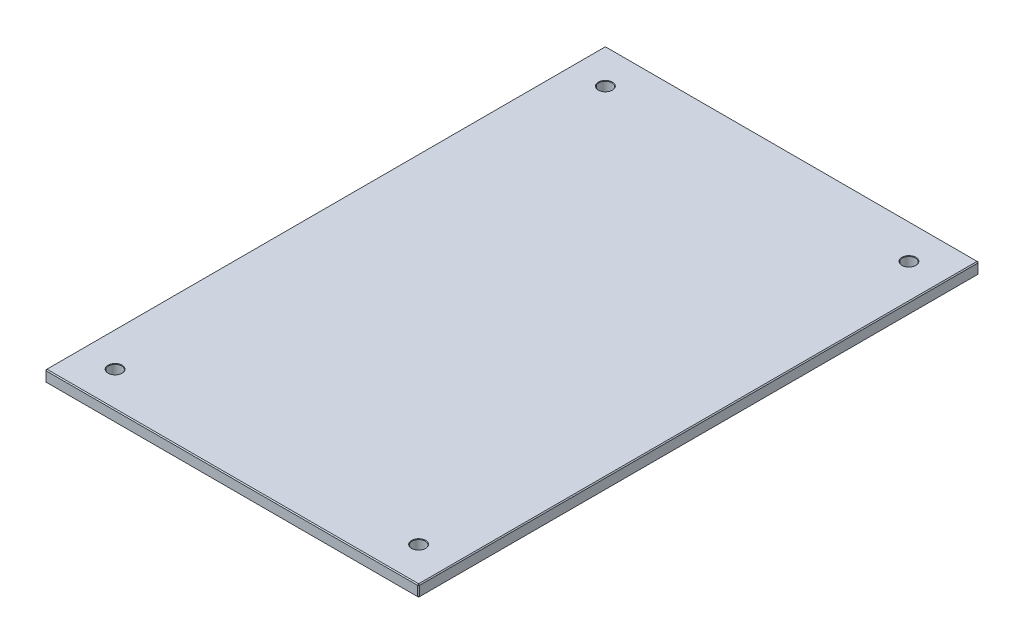
ISO-10303-21;
HEADER;
FILE_DESCRIPTION(('STEP AP214'),'2;1');
FILE_NAME('part.step','',(''),(''),'','','');
FILE_SCHEMA(('AUTOMOTIVE_DESIGN { 1 0 10303 214 1 1 1 1 }'));
ENDSEC;
DATA;
#1=APPLICATION_CONTEXT('core data for automotive mechanical design processes');
#2=APPLICATION_PROTOCOL_DEFINITION('international standard','automotive_design',2000,#1);
#3=PRODUCT_CONTEXT('',#1,'mechanical');
#4=PRODUCT('Part','Part','',(#3));
#5=PRODUCT_RELATED_PRODUCT_CATEGORY('part','',(#4));
#6=PRODUCT_DEFINITION_FORMATION('','',#4);
#7=PRODUCT_DEFINITION_CONTEXT('part definition',#1,'design');
#8=PRODUCT_DEFINITION('design','',#6,#7);
#9=PRODUCT_DEFINITION_SHAPE('','',#8);
#10=(LENGTH_UNIT() NAMED_UNIT(*) SI_UNIT(.MILLI.,.METRE.));
#11=(NAMED_UNIT(*) PLANE_ANGLE_UNIT() SI_UNIT($,.RADIAN.));
#12=(NAMED_UNIT(*) SI_UNIT($,.STERADIAN.) SOLID_ANGLE_UNIT());
#13=UNCERTAINTY_MEASURE_WITH_UNIT(LENGTH_MEASURE(1.E-05),#10,'distance_accuracy_value','');
#14=(GEOMETRIC_REPRESENTATION_CONTEXT(3) GLOBAL_UNCERTAINTY_ASSIGNED_CONTEXT((#13)) GLOBAL_UNIT_ASSIGNED_CONTEXT((#10,
#11,#12)) REPRESENTATION_CONTEXT('',''));
#15=CARTESIAN_POINT('',(0.,0.,0.));
#16=DIRECTION('',(0.,0.,1.));
#17=DIRECTION('',(1.,0.,0.));
#18=AXIS2_PLACEMENT_3D('',#15,#16,#17);
#19=CARTESIAN_POINT('',(101.6,3.175,152.4));
#20=DIRECTION('',(-1.,0.,0.));
#21=DIRECTION('',(0.,0.,1.));
#22=AXIS2_PLACEMENT_3D('',#19,#20,#21);
#23=PLANE('',#22);
#24=DIRECTION('',(0.,0.,-1.));
#25=VECTOR('',#24,1.);
#26=CARTESIAN_POINT('',(101.6,-2.66699999999999,-152.4));
#27=LINE('',#26,#25);
#28=CARTESIAN_POINT('',(101.6,-2.66699999999999,151.892));
#29=VERTEX_POINT('',#28);
#30=CARTESIAN_POINT('',(101.6,-2.66699999999999,-151.892));
#31=VERTEX_POINT('',#30);
#32=EDGE_CURVE('E178',#29,#31,#27,.T.);
#33=ORIENTED_EDGE('',*,*,#32,.T.);
#34=DIRECTION('',(0.,1.,0.));
#35=VECTOR('',#34,1.);
#36=CARTESIAN_POINT('',(101.6,3.175,-151.892));
#37=LINE('',#36,#35);
#38=CARTESIAN_POINT('',(101.6,2.66699999999999,-151.892));
#39=VERTEX_POINT('',#38);
#40=EDGE_CURVE('E183',#31,#39,#37,.T.);
#41=ORIENTED_EDGE('',*,*,#40,.T.);
#42=DIRECTION('',(0.,0.,1.));
#43=VECTOR('',#42,1.);
#44=CARTESIAN_POINT('',(101.6,2.66699999999999,152.4));
#45=LINE('',#44,#43);
#46=CARTESIAN_POINT('',(101.6,2.66699999999999,151.892));
#47=VERTEX_POINT('',#46);
#48=EDGE_CURVE('E180',#39,#47,#45,.T.);
#49=ORIENTED_EDGE('',*,*,#48,.T.);
#50=DIRECTION('',(0.,-1.,0.));
#51=VECTOR('',#50,1.);
#52=CARTESIAN_POINT('',(101.6,3.175,151.892));
#53=LINE('',#52,#51);
#54=EDGE_CURVE('E176',#47,#29,#53,.T.);
#55=ORIENTED_EDGE('',*,*,#54,.T.);
#56=EDGE_LOOP('',(#33,#41,#49,#55));
#57=FACE_BOUND('',#56,.T.);
#58=ADVANCED_FACE('F41',(#57),#23,.F.);
#59=CARTESIAN_POINT('',(-101.6,3.175,-152.4));
#60=DIRECTION('',(0.,0.,1.));
#61=DIRECTION('',(1.,0.,0.));
#62=AXIS2_PLACEMENT_3D('',#59,#60,#61);
#63=PLANE('',#62);
#64=DIRECTION('',(1.,0.,0.));
#65=VECTOR('',#64,1.);
#66=CARTESIAN_POINT('',(-101.6,2.66699999999999,-152.4));
#67=LINE('',#66,#65);
#68=CARTESIAN_POINT('',(-101.092,2.66699999999999,-152.4));
#69=VERTEX_POINT('',#68);
#70=CARTESIAN_POINT('',(101.092,2.66699999999999,-152.4));
#71=VERTEX_POINT('',#70);
#72=EDGE_CURVE('E198',#69,#71,#67,.T.);
#73=ORIENTED_EDGE('',*,*,#72,.T.);
#74=DIRECTION('',(0.,-1.,0.));
#75=VECTOR('',#74,1.);
#76=CARTESIAN_POINT('',(101.092,3.175,-152.4));
#77=LINE('',#76,#75);
#78=CARTESIAN_POINT('',(101.092,-2.66699999999999,-152.4));
#79=VERTEX_POINT('',#78);
#80=EDGE_CURVE('E200',#71,#79,#77,.T.);
#81=ORIENTED_EDGE('',*,*,#80,.T.);
#82=DIRECTION('',(-1.,0.,0.));
#83=VECTOR('',#82,1.);
#84=CARTESIAN_POINT('',(-101.6,-2.66699999999999,-152.4));
#85=LINE('',#84,#83);
#86=CARTESIAN_POINT('',(-101.092,-2.66699999999999,-152.4));
#87=VERTEX_POINT('',#86);
#88=EDGE_CURVE('E196',#79,#87,#85,.T.);
#89=ORIENTED_EDGE('',*,*,#88,.T.);
#90=DIRECTION('',(0.,1.,0.));
#91=VECTOR('',#90,1.);
#92=CARTESIAN_POINT('',(-101.092,3.175,-152.4));
#93=LINE('',#92,#91);
#94=EDGE_CURVE('E194',#87,#69,#93,.T.);
#95=ORIENTED_EDGE('',*,*,#94,.T.);
#96=EDGE_LOOP('',(#73,#81,#89,#95));
#97=FACE_BOUND('',#96,.T.);
#98=ADVANCED_FACE('F344',(#97),#63,.F.);
#99=CARTESIAN_POINT('',(-101.6,3.175,152.4));
#100=DIRECTION('',(1.,0.,0.));
#101=DIRECTION('',(0.,0.,-1.));
#102=AXIS2_PLACEMENT_3D('',#99,#100,#101);
#103=PLANE('',#102);
#104=DIRECTION('',(0.,0.,-1.));
#105=VECTOR('',#104,1.);
#106=CARTESIAN_POINT('',(-101.6,2.66699999999999,152.4));
#107=LINE('',#106,#105);
#108=CARTESIAN_POINT('',(-101.6,2.66699999999999,151.892));
#109=VERTEX_POINT('',#108);
#110=CARTESIAN_POINT('',(-101.6,2.66699999999999,-151.892));
#111=VERTEX_POINT('',#110);
#112=EDGE_CURVE('E148',#109,#111,#107,.T.);
#113=ORIENTED_EDGE('',*,*,#112,.T.);
#114=DIRECTION('',(0.,-1.,0.));
#115=VECTOR('',#114,1.);
#116=CARTESIAN_POINT('',(-101.6,3.175,-151.892));
#117=LINE('',#116,#115);
#118=CARTESIAN_POINT('',(-101.6,-2.66699999999999,-151.892));
#119=VERTEX_POINT('',#118);
#120=EDGE_CURVE('E208',#111,#119,#117,.T.);
#121=ORIENTED_EDGE('',*,*,#120,.T.);
#122=DIRECTION('',(0.,0.,1.));
#123=VECTOR('',#122,1.);
#124=CARTESIAN_POINT('',(-101.6,-2.66699999999999,152.4));
#125=LINE('',#124,#123);
#126=CARTESIAN_POINT('',(-101.6,-2.66699999999999,151.892));
#127=VERTEX_POINT('',#126);
#128=EDGE_CURVE('E205',#119,#127,#125,.T.);
#129=ORIENTED_EDGE('',*,*,#128,.T.);
#130=DIRECTION('',(0.,1.,0.));
#131=VECTOR('',#130,1.);
#132=CARTESIAN_POINT('',(-101.6,3.175,151.892));
#133=LINE('',#132,#131);
#134=EDGE_CURVE('E203',#127,#109,#133,.T.);
#135=ORIENTED_EDGE('',*,*,#134,.T.);
#136=EDGE_LOOP('',(#113,#121,#129,#135));
#137=FACE_BOUND('',#136,.T.);
#138=ADVANCED_FACE('F340',(#137),#103,.F.);
#139=CARTESIAN_POINT('',(-101.6,3.175,152.4));
#140=DIRECTION('',(0.,0.,-1.));
#141=DIRECTION('',(-1.,0.,0.));
#142=AXIS2_PLACEMENT_3D('',#139,#140,#141);
#143=PLANE('',#142);
#144=DIRECTION('',(-1.,0.,0.));
#145=VECTOR('',#144,1.);
#146=CARTESIAN_POINT('',(-101.6,2.66699999999999,152.4));
#147=LINE('',#146,#145);
#148=CARTESIAN_POINT('',(101.092,2.66699999999999,152.4));
#149=VERTEX_POINT('',#148);
#150=CARTESIAN_POINT('',(-101.092,2.66699999999999,152.4));
#151=VERTEX_POINT('',#150);
#152=EDGE_CURVE('E51',#149,#151,#147,.T.);
#153=ORIENTED_EDGE('',*,*,#152,.T.);
#154=DIRECTION('',(0.,-1.,0.));
#155=VECTOR('',#154,1.);
#156=CARTESIAN_POINT('',(-101.092,3.175,152.4));
#157=LINE('',#156,#155);
#158=CARTESIAN_POINT('',(-101.092,-2.66699999999999,152.4));
#159=VERTEX_POINT('',#158);
#160=EDGE_CURVE('E11',#151,#159,#157,.T.);
#161=ORIENTED_EDGE('',*,*,#160,.T.);
#162=DIRECTION('',(1.,0.,0.));
#163=VECTOR('',#162,1.);
#164=CARTESIAN_POINT('',(101.6,-2.66699999999999,152.4));
#165=LINE('',#164,#163);
#166=CARTESIAN_POINT('',(101.092,-2.66699999999999,152.4));
#167=VERTEX_POINT('',#166);
#168=EDGE_CURVE('E211',#159,#167,#165,.T.);
#169=ORIENTED_EDGE('',*,*,#168,.T.);
#170=DIRECTION('',(0.,1.,0.));
#171=VECTOR('',#170,1.);
#172=CARTESIAN_POINT('',(101.092,3.175,152.4));
#173=LINE('',#172,#171);
#174=EDGE_CURVE('E62',#167,#149,#173,.T.);
#175=ORIENTED_EDGE('',*,*,#174,.T.);
#176=EDGE_LOOP('',(#153,#161,#169,#175));
#177=FACE_BOUND('',#176,.T.);
#178=ADVANCED_FACE('F331',(#177),#143,.F.);
#179=CARTESIAN_POINT('',(0.,3.175,0.));
#180=DIRECTION('',(0.,-1.,0.));
#181=DIRECTION('',(0.,0.,-1.));
#182=AXIS2_PLACEMENT_3D('',#179,#180,#181);
#183=PLANE('',#182);
#184=DIRECTION('',(1.,0.,0.));
#185=VECTOR('',#184,1.);
#186=CARTESIAN_POINT('',(0.,3.175,151.892));
#187=LINE('',#186,#185);
#188=CARTESIAN_POINT('',(-101.092,3.175,151.892));
#189=VERTEX_POINT('',#188);
#190=CARTESIAN_POINT('',(101.092,3.175,151.892));
#191=VERTEX_POINT('',#190);
#192=EDGE_CURVE('E135',#189,#191,#187,.T.);
#193=ORIENTED_EDGE('',*,*,#192,.T.);
#194=DIRECTION('',(0.,0.,-1.));
#195=VECTOR('',#194,1.);
#196=CARTESIAN_POINT('',(101.092,3.175,0.));
#197=LINE('',#196,#195);
#198=CARTESIAN_POINT('',(101.092,3.175,-151.892));
#199=VERTEX_POINT('',#198);
#200=EDGE_CURVE('E174',#191,#199,#197,.T.);
#201=ORIENTED_EDGE('',*,*,#200,.T.);
#202=DIRECTION('',(-1.,0.,0.));
#203=VECTOR('',#202,1.);
#204=CARTESIAN_POINT('',(0.,3.175,-151.892));
#205=LINE('',#204,#203);
#206=CARTESIAN_POINT('',(-101.092,3.175,-151.892));
#207=VERTEX_POINT('',#206);
#208=EDGE_CURVE('E138',#199,#207,#205,.T.);
#209=ORIENTED_EDGE('',*,*,#208,.T.);
#210=DIRECTION('',(0.,0.,1.));
#211=VECTOR('',#210,1.);
#212=CARTESIAN_POINT('',(-101.092,3.175,0.));
#213=LINE('',#212,#211);
#214=EDGE_CURVE('E129',#207,#189,#213,.T.);
#215=ORIENTED_EDGE('',*,*,#214,.T.);
#216=EDGE_LOOP('',(#193,#201,#209,#215));
#217=FACE_BOUND('',#216,.T.);
#218=CARTESIAN_POINT('',(-82.55,3.175,-133.35));
#219=DIRECTION('',(0.,1.,0.));
#220=DIRECTION('',(0.,0.,1.));
#221=AXIS2_PLACEMENT_3D('',#218,#219,#220);
#222=CIRCLE('',#221,3.82523999999999);
#223=CARTESIAN_POINT('',(-82.55,3.175,-129.52476));
#224=VERTEX_POINT('',#223);
#225=EDGE_CURVE('E275',#224,#224,#222,.T.);
#226=ORIENTED_EDGE('',*,*,#225,.F.);
#227=EDGE_LOOP('',(#226));
#228=FACE_BOUND('',#227,.T.);
#229=CARTESIAN_POINT('',(82.55,3.175,-133.35));
#230=DIRECTION('',(0.,1.,0.));
#231=DIRECTION('',(0.,0.,1.));
#232=AXIS2_PLACEMENT_3D('',#229,#230,#231);
#233=CIRCLE('',#232,3.82523999999999);
#234=CARTESIAN_POINT('',(82.55,3.175,-129.52476));
#235=VERTEX_POINT('',#234);
#236=EDGE_CURVE('E291',#235,#235,#233,.T.);
#237=ORIENTED_EDGE('',*,*,#236,.F.);
#238=EDGE_LOOP('',(#237));
#239=FACE_BOUND('',#238,.T.);
#240=CARTESIAN_POINT('',(82.55,3.175,133.35));
#241=DIRECTION('',(0.,1.,0.));
#242=DIRECTION('',(0.,0.,1.));
#243=AXIS2_PLACEMENT_3D('',#240,#241,#242);
#244=CIRCLE('',#243,3.82523999999999);
#245=CARTESIAN_POINT('',(82.55,3.175,137.17524));
#246=VERTEX_POINT('',#245);
#247=EDGE_CURVE('E303',#246,#246,#244,.T.);
#248=ORIENTED_EDGE('',*,*,#247,.F.);
#249=EDGE_LOOP('',(#248));
#250=FACE_BOUND('',#249,.T.);
#251=CARTESIAN_POINT('',(-82.55,3.175,133.35));
#252=DIRECTION('',(0.,1.,0.));
#253=DIRECTION('',(0.,0.,1.));
#254=AXIS2_PLACEMENT_3D('',#251,#252,#253);
#255=CIRCLE('',#254,3.82523999999999);
#256=CARTESIAN_POINT('',(-82.55,3.175,137.17524));
#257=VERTEX_POINT('',#256);
#258=EDGE_CURVE('E315',#257,#257,#255,.T.);
#259=ORIENTED_EDGE('',*,*,#258,.F.);
#260=EDGE_LOOP('',(#259));
#261=FACE_BOUND('',#260,.T.);
#262=ADVANCED_FACE('F131',(#217,#228,#239,#250,#261),#183,.F.);
#263=CARTESIAN_POINT('',(0.,-3.175,0.));
#264=DIRECTION('',(0.,-1.,0.));
#265=DIRECTION('',(0.,0.,-1.));
#266=AXIS2_PLACEMENT_3D('',#263,#264,#265);
#267=PLANE('',#266);
#268=DIRECTION('',(1.,0.,0.));
#269=VECTOR('',#268,1.);
#270=CARTESIAN_POINT('',(101.6,-3.175,-151.892));
#271=LINE('',#270,#269);
#272=CARTESIAN_POINT('',(-101.092,-3.175,-151.892));
#273=VERTEX_POINT('',#272);
#274=CARTESIAN_POINT('',(101.092,-3.175,-151.892));
#275=VERTEX_POINT('',#274);
#276=EDGE_CURVE('E189',#273,#275,#271,.T.);
#277=ORIENTED_EDGE('',*,*,#276,.T.);
#278=DIRECTION('',(0.,0.,1.));
#279=VECTOR('',#278,1.);
#280=CARTESIAN_POINT('',(101.092,-3.175,152.4));
#281=LINE('',#280,#279);
#282=CARTESIAN_POINT('',(101.092,-3.175,151.892));
#283=VERTEX_POINT('',#282);
#284=EDGE_CURVE('E191',#275,#283,#281,.T.);
#285=ORIENTED_EDGE('',*,*,#284,.T.);
#286=DIRECTION('',(-1.,0.,0.));
#287=VECTOR('',#286,1.);
#288=CARTESIAN_POINT('',(-101.6,-3.175,151.892));
#289=LINE('',#288,#287);
#290=CARTESIAN_POINT('',(-101.092,-3.175,151.892));
#291=VERTEX_POINT('',#290);
#292=EDGE_CURVE('E185',#283,#291,#289,.T.);
#293=ORIENTED_EDGE('',*,*,#292,.T.);
#294=DIRECTION('',(0.,0.,-1.));
#295=VECTOR('',#294,1.);
#296=CARTESIAN_POINT('',(-101.092,-3.175,-152.4));
#297=LINE('',#296,#295);
#298=EDGE_CURVE('E187',#291,#273,#297,.T.);
#299=ORIENTED_EDGE('',*,*,#298,.T.);
#300=EDGE_LOOP('',(#277,#285,#293,#299));
#301=FACE_BOUND('',#300,.T.);
#302=CARTESIAN_POINT('',(-82.55,-3.175,-133.35));
#303=DIRECTION('',(0.,1.,0.));
#304=DIRECTION('',(0.,0.,1.));
#305=AXIS2_PLACEMENT_3D('',#302,#303,#304);
#306=CIRCLE('',#305,3.82523999999999);
#307=CARTESIAN_POINT('',(-82.55,-3.175,-129.52476));
#308=VERTEX_POINT('',#307);
#309=EDGE_CURVE('E269',#308,#308,#306,.T.);
#310=ORIENTED_EDGE('',*,*,#309,.T.);
#311=EDGE_LOOP('',(#310));
#312=FACE_BOUND('',#311,.T.);
#313=CARTESIAN_POINT('',(82.55,-3.175,-133.35));
#314=DIRECTION('',(0.,1.,0.));
#315=DIRECTION('',(0.,0.,1.));
#316=AXIS2_PLACEMENT_3D('',#313,#314,#315);
#317=CIRCLE('',#316,3.82523999999999);
#318=CARTESIAN_POINT('',(82.55,-3.175,-129.52476));
#319=VERTEX_POINT('',#318);
#320=EDGE_CURVE('E288',#319,#319,#317,.T.);
#321=ORIENTED_EDGE('',*,*,#320,.T.);
#322=EDGE_LOOP('',(#321));
#323=FACE_BOUND('',#322,.T.);
#324=CARTESIAN_POINT('',(82.55,-3.175,133.35));
#325=DIRECTION('',(0.,1.,0.));
#326=DIRECTION('',(0.,0.,1.));
#327=AXIS2_PLACEMENT_3D('',#324,#325,#326);
#328=CIRCLE('',#327,3.82523999999999);
#329=CARTESIAN_POINT('',(82.55,-3.175,137.17524));
#330=VERTEX_POINT('',#329);
#331=EDGE_CURVE('E300',#330,#330,#328,.T.);
#332=ORIENTED_EDGE('',*,*,#331,.T.);
#333=EDGE_LOOP('',(#332));
#334=FACE_BOUND('',#333,.T.);
#335=CARTESIAN_POINT('',(-82.55,-3.175,133.35));
#336=DIRECTION('',(0.,1.,0.));
#337=DIRECTION('',(0.,0.,1.));
#338=AXIS2_PLACEMENT_3D('',#335,#336,#337);
#339=CIRCLE('',#338,3.82523999999999);
#340=CARTESIAN_POINT('',(-82.55,-3.175,137.17524));
#341=VERTEX_POINT('',#340);
#342=EDGE_CURVE('E312',#341,#341,#339,.T.);
#343=ORIENTED_EDGE('',*,*,#342,.T.);
#344=EDGE_LOOP('',(#343));
#345=FACE_BOUND('',#344,.T.);
#346=ADVANCED_FACE('F330',(#301,#312,#323,#334,#345),#267,.T.);
#347=CARTESIAN_POINT('',(-82.55,-2.921,133.35));
#348=DIRECTION('',(0.,-1.,0.));
#349=DIRECTION('',(0.,0.,-1.));
#350=AXIS2_PLACEMENT_3D('',#347,#348,#349);
#351=CONICAL_SURFACE('',#350,3.57124,0.785398163397426);
#352=ORIENTED_EDGE('',*,*,#342,.F.);
#353=EDGE_LOOP('',(#352));
#354=FACE_BOUND('',#353,.T.);
#355=CARTESIAN_POINT('',(-82.55,-2.921,133.35));
#356=DIRECTION('',(0.,1.,0.));
#357=DIRECTION('',(0.,0.,1.));
#358=AXIS2_PLACEMENT_3D('',#355,#356,#357);
#359=CIRCLE('',#358,3.57124);
#360=CARTESIAN_POINT('',(-82.55,-2.921,136.92124));
#361=VERTEX_POINT('',#360);
#362=EDGE_CURVE('E166',#361,#361,#359,.T.);
#363=ORIENTED_EDGE('',*,*,#362,.T.);
#364=EDGE_LOOP('',(#363));
#365=FACE_BOUND('',#364,.T.);
#366=ADVANCED_FACE('F337',(#354,#365),#351,.F.);
#367=CARTESIAN_POINT('',(-82.55,3.175,133.35));
#368=DIRECTION('',(0.,1.,0.));
#369=DIRECTION('',(0.,0.,1.));
#370=AXIS2_PLACEMENT_3D('',#367,#368,#369);
#371=CYLINDRICAL_SURFACE('',#370,3.57124);
#372=ORIENTED_EDGE('',*,*,#362,.F.);
#373=EDGE_LOOP('',(#372));
#374=FACE_BOUND('',#373,.T.);
#375=CARTESIAN_POINT('',(-82.55,2.921,133.35));
#376=DIRECTION('',(0.,1.,0.));
#377=DIRECTION('',(0.,0.,1.));
#378=AXIS2_PLACEMENT_3D('',#375,#376,#377);
#379=CIRCLE('',#378,3.57124);
#380=CARTESIAN_POINT('',(-82.55,2.921,136.92124));
#381=VERTEX_POINT('',#380);
#382=EDGE_CURVE('E169',#381,#381,#379,.T.);
#383=ORIENTED_EDGE('',*,*,#382,.T.);
#384=EDGE_LOOP('',(#383));
#385=FACE_BOUND('',#384,.T.);
#386=ADVANCED_FACE('F320',(#374,#385),#371,.F.);
#387=CARTESIAN_POINT('',(-82.55,3.175,133.35));
#388=DIRECTION('',(0.,1.,0.));
#389=DIRECTION('',(0.,0.,1.));
#390=AXIS2_PLACEMENT_3D('',#387,#388,#389);
#391=CONICAL_SURFACE('',#390,3.82523999999999,0.785398163397428);
#392=ORIENTED_EDGE('',*,*,#382,.F.);
#393=EDGE_LOOP('',(#392));
#394=FACE_BOUND('',#393,.T.);
#395=ORIENTED_EDGE('',*,*,#258,.T.);
#396=EDGE_LOOP('',(#395));
#397=FACE_BOUND('',#396,.T.);
#398=ADVANCED_FACE('F322',(#394,#397),#391,.F.);
#399=CARTESIAN_POINT('',(82.55,-2.921,133.35));
#400=DIRECTION('',(0.,-1.,0.));
#401=DIRECTION('',(0.,0.,-1.));
#402=AXIS2_PLACEMENT_3D('',#399,#400,#401);
#403=CONICAL_SURFACE('',#402,3.57124,0.785398163397426);
#404=ORIENTED_EDGE('',*,*,#331,.F.);
#405=EDGE_LOOP('',(#404));
#406=FACE_BOUND('',#405,.T.);
#407=CARTESIAN_POINT('',(82.55,-2.921,133.35));
#408=DIRECTION('',(0.,1.,0.));
#409=DIRECTION('',(0.,0.,1.));
#410=AXIS2_PLACEMENT_3D('',#407,#408,#409);
#411=CIRCLE('',#410,3.57124);
#412=CARTESIAN_POINT('',(82.55,-2.921,136.92124));
#413=VERTEX_POINT('',#412);
#414=EDGE_CURVE('E309',#413,#413,#411,.T.);
#415=ORIENTED_EDGE('',*,*,#414,.T.);
#416=EDGE_LOOP('',(#415));
#417=FACE_BOUND('',#416,.T.);
#418=ADVANCED_FACE('F325',(#406,#417),#403,.F.);
#419=CARTESIAN_POINT('',(82.55,3.175,133.35));
#420=DIRECTION('',(0.,1.,0.));
#421=DIRECTION('',(0.,0.,1.));
#422=AXIS2_PLACEMENT_3D('',#419,#420,#421);
#423=CYLINDRICAL_SURFACE('',#422,3.57124);
#424=ORIENTED_EDGE('',*,*,#414,.F.);
#425=EDGE_LOOP('',(#424));
#426=FACE_BOUND('',#425,.T.);
#427=CARTESIAN_POINT('',(82.55,2.921,133.35));
#428=DIRECTION('',(0.,1.,0.));
#429=DIRECTION('',(0.,0.,1.));
#430=AXIS2_PLACEMENT_3D('',#427,#428,#429);
#431=CIRCLE('',#430,3.57124);
#432=CARTESIAN_POINT('',(82.55,2.921,136.92124));
#433=VERTEX_POINT('',#432);
#434=EDGE_CURVE('E306',#433,#433,#431,.T.);
#435=ORIENTED_EDGE('',*,*,#434,.T.);
#436=EDGE_LOOP('',(#435));
#437=FACE_BOUND('',#436,.T.);
#438=ADVANCED_FACE('F529',(#426,#437),#423,.F.);
#439=CARTESIAN_POINT('',(82.55,3.175,133.35));
#440=DIRECTION('',(0.,1.,0.));
#441=DIRECTION('',(0.,0.,1.));
#442=AXIS2_PLACEMENT_3D('',#439,#440,#441);
#443=CONICAL_SURFACE('',#442,3.82523999999999,0.785398163397428);
#444=ORIENTED_EDGE('',*,*,#434,.F.);
#445=EDGE_LOOP('',(#444));
#446=FACE_BOUND('',#445,.T.);
#447=ORIENTED_EDGE('',*,*,#247,.T.);
#448=EDGE_LOOP('',(#447));
#449=FACE_BOUND('',#448,.T.);
#450=ADVANCED_FACE('F533',(#446,#449),#443,.F.);
#451=CARTESIAN_POINT('',(82.55,-2.921,-133.35));
#452=DIRECTION('',(0.,-1.,0.));
#453=DIRECTION('',(0.,0.,-1.));
#454=AXIS2_PLACEMENT_3D('',#451,#452,#453);
#455=CONICAL_SURFACE('',#454,3.57124,0.785398163397426);
#456=ORIENTED_EDGE('',*,*,#320,.F.);
#457=EDGE_LOOP('',(#456));
#458=FACE_BOUND('',#457,.T.);
#459=CARTESIAN_POINT('',(82.55,-2.921,-133.35));
#460=DIRECTION('',(0.,1.,0.));
#461=DIRECTION('',(0.,0.,1.));
#462=AXIS2_PLACEMENT_3D('',#459,#460,#461);
#463=CIRCLE('',#462,3.57124);
#464=CARTESIAN_POINT('',(82.55,-2.921,-129.77876));
#465=VERTEX_POINT('',#464);
#466=EDGE_CURVE('E297',#465,#465,#463,.T.);
#467=ORIENTED_EDGE('',*,*,#466,.T.);
#468=EDGE_LOOP('',(#467));
#469=FACE_BOUND('',#468,.T.);
#470=ADVANCED_FACE('F537',(#458,#469),#455,.F.);
#471=CARTESIAN_POINT('',(82.55,3.175,-133.35));
#472=DIRECTION('',(0.,1.,0.));
#473=DIRECTION('',(0.,0.,1.));
#474=AXIS2_PLACEMENT_3D('',#471,#472,#473);
#475=CYLINDRICAL_SURFACE('',#474,3.57124);
#476=ORIENTED_EDGE('',*,*,#466,.F.);
#477=EDGE_LOOP('',(#476));
#478=FACE_BOUND('',#477,.T.);
#479=CARTESIAN_POINT('',(82.55,2.921,-133.35));
#480=DIRECTION('',(0.,1.,0.));
#481=DIRECTION('',(0.,0.,1.));
#482=AXIS2_PLACEMENT_3D('',#479,#480,#481);
#483=CIRCLE('',#482,3.57124);
#484=CARTESIAN_POINT('',(82.55,2.921,-129.77876));
#485=VERTEX_POINT('',#484);
#486=EDGE_CURVE('E294',#485,#485,#483,.T.);
#487=ORIENTED_EDGE('',*,*,#486,.T.);
#488=EDGE_LOOP('',(#487));
#489=FACE_BOUND('',#488,.T.);
#490=ADVANCED_FACE('F541',(#478,#489),#475,.F.);
#491=CARTESIAN_POINT('',(82.55,3.175,-133.35));
#492=DIRECTION('',(0.,1.,0.));
#493=DIRECTION('',(0.,0.,1.));
#494=AXIS2_PLACEMENT_3D('',#491,#492,#493);
#495=CONICAL_SURFACE('',#494,3.82523999999999,0.785398163397428);
#496=ORIENTED_EDGE('',*,*,#486,.F.);
#497=EDGE_LOOP('',(#496));
#498=FACE_BOUND('',#497,.T.);
#499=ORIENTED_EDGE('',*,*,#236,.T.);
#500=EDGE_LOOP('',(#499));
#501=FACE_BOUND('',#500,.T.);
#502=ADVANCED_FACE('F545',(#498,#501),#495,.F.);
#503=CARTESIAN_POINT('',(-82.55,-2.921,-133.35));
#504=DIRECTION('',(0.,-1.,0.));
#505=DIRECTION('',(0.,0.,-1.));
#506=AXIS2_PLACEMENT_3D('',#503,#504,#505);
#507=CONICAL_SURFACE('',#506,3.57124,0.785398163397426);
#508=ORIENTED_EDGE('',*,*,#309,.F.);
#509=EDGE_LOOP('',(#508));
#510=FACE_BOUND('',#509,.T.);
#511=CARTESIAN_POINT('',(-82.55,-2.921,-133.35));
#512=DIRECTION('',(0.,1.,0.));
#513=DIRECTION('',(0.,0.,1.));
#514=AXIS2_PLACEMENT_3D('',#511,#512,#513);
#515=CIRCLE('',#514,3.57124);
#516=CARTESIAN_POINT('',(-82.55,-2.921,-129.77876));
#517=VERTEX_POINT('',#516);
#518=EDGE_CURVE('E285',#517,#517,#515,.T.);
#519=ORIENTED_EDGE('',*,*,#518,.T.);
#520=EDGE_LOOP('',(#519));
#521=FACE_BOUND('',#520,.T.);
#522=ADVANCED_FACE('F549',(#510,#521),#507,.F.);
#523=CARTESIAN_POINT('',(-82.55,3.175,-133.35));
#524=DIRECTION('',(0.,1.,0.));
#525=DIRECTION('',(0.,0.,1.));
#526=AXIS2_PLACEMENT_3D('',#523,#524,#525);
#527=CYLINDRICAL_SURFACE('',#526,3.57124);
#528=ORIENTED_EDGE('',*,*,#518,.F.);
#529=EDGE_LOOP('',(#528));
#530=FACE_BOUND('',#529,.T.);
#531=CARTESIAN_POINT('',(-82.55,2.921,-133.35));
#532=DIRECTION('',(0.,1.,0.));
#533=DIRECTION('',(0.,0.,1.));
#534=AXIS2_PLACEMENT_3D('',#531,#532,#533);
#535=CIRCLE('',#534,3.57124);
#536=CARTESIAN_POINT('',(-82.55,2.921,-129.77876));
#537=VERTEX_POINT('',#536);
#538=EDGE_CURVE('E280',#537,#537,#535,.T.);
#539=ORIENTED_EDGE('',*,*,#538,.T.);
#540=EDGE_LOOP('',(#539));
#541=FACE_BOUND('',#540,.T.);
#542=ADVANCED_FACE('F553',(#530,#541),#527,.F.);
#543=CARTESIAN_POINT('',(-82.55,3.175,-133.35));
#544=DIRECTION('',(0.,1.,0.));
#545=DIRECTION('',(0.,0.,1.));
#546=AXIS2_PLACEMENT_3D('',#543,#544,#545);
#547=CONICAL_SURFACE('',#546,3.82523999999999,0.785398163397428);
#548=ORIENTED_EDGE('',*,*,#538,.F.);
#549=EDGE_LOOP('',(#548));
#550=FACE_BOUND('',#549,.T.);
#551=ORIENTED_EDGE('',*,*,#225,.T.);
#552=EDGE_LOOP('',(#551));
#553=FACE_BOUND('',#552,.T.);
#554=ADVANCED_FACE('F481',(#550,#553),#547,.F.);
#555=CARTESIAN_POINT('',(-101.6,-2.66699999999999,152.4));
#556=DIRECTION('',(-0.707106781186547,-0.707106781186547,0.));
#557=DIRECTION('',(0.,0.,-1.));
#558=AXIS2_PLACEMENT_3D('',#555,#556,#557);
#559=PLANE('',#558);
#560=DIRECTION('',(0.707106781186547,-0.707106781186547,0.));
#561=VECTOR('',#560,1.);
#562=CARTESIAN_POINT('',(-101.6,-2.66699999999999,151.892));
#563=LINE('',#562,#561);
#564=EDGE_CURVE('E46',#127,#291,#563,.T.);
#565=ORIENTED_EDGE('',*,*,#564,.F.);
#566=ORIENTED_EDGE('',*,*,#128,.F.);
#567=DIRECTION('',(-0.707106781186547,0.707106781186547,0.));
#568=VECTOR('',#567,1.);
#569=CARTESIAN_POINT('',(-101.346,-2.921,-151.892));
#570=LINE('',#569,#568);
#571=EDGE_CURVE('E261',#273,#119,#570,.T.);
#572=ORIENTED_EDGE('',*,*,#571,.F.);
#573=ORIENTED_EDGE('',*,*,#298,.F.);
#574=EDGE_LOOP('',(#565,#566,#572,#573));
#575=FACE_BOUND('',#574,.T.);
#576=ADVANCED_FACE('F44',(#575),#559,.T.);
#577=CARTESIAN_POINT('',(-101.6,-2.66699999999999,151.892));
#578=DIRECTION('',(-0.577350269189626,-0.577350269189626,0.577350269189626));
#579=DIRECTION('',(0.707106781186547,0.,0.707106781186547));
#580=AXIS2_PLACEMENT_3D('',#577,#578,#579);
#581=PLANE('',#580);
#582=DIRECTION('',(0.707106781186547,0.,0.707106781186547));
#583=VECTOR('',#582,1.);
#584=CARTESIAN_POINT('',(-101.6,-2.66699999999999,151.892));
#585=LINE('',#584,#583);
#586=EDGE_CURVE('E256',#127,#159,#585,.T.);
#587=ORIENTED_EDGE('',*,*,#586,.F.);
#588=ORIENTED_EDGE('',*,*,#564,.T.);
#589=DIRECTION('',(0.,0.707106781186547,0.707106781186547));
#590=VECTOR('',#589,1.);
#591=CARTESIAN_POINT('',(-101.092,-2.921,152.146));
#592=LINE('',#591,#590);
#593=EDGE_CURVE('E259',#159,#291,#592,.F.);
#594=ORIENTED_EDGE('',*,*,#593,.F.);
#595=EDGE_LOOP('',(#587,#588,#594));
#596=FACE_BOUND('',#595,.T.);
#597=ADVANCED_FACE('F474',(#596),#581,.T.);
#598=CARTESIAN_POINT('',(-101.092,-2.66699999999999,-152.4));
#599=DIRECTION('',(-0.577350269189626,-0.577350269189626,-0.577350269189626));
#600=DIRECTION('',(-0.707106781186547,0.,0.707106781186547));
#601=AXIS2_PLACEMENT_3D('',#598,#599,#600);
#602=PLANE('',#601);
#603=DIRECTION('',(0.,-0.707106781186547,0.707106781186547));
#604=VECTOR('',#603,1.);
#605=CARTESIAN_POINT('',(-101.092,-2.66699999999999,-152.4));
#606=LINE('',#605,#604);
#607=EDGE_CURVE('E251',#273,#87,#606,.F.);
#608=ORIENTED_EDGE('',*,*,#607,.F.);
#609=ORIENTED_EDGE('',*,*,#571,.T.);
#610=DIRECTION('',(-0.707106781186547,0.,0.707106781186547));
#611=VECTOR('',#610,1.);
#612=CARTESIAN_POINT('',(-101.092,-2.66699999999999,-152.4));
#613=LINE('',#612,#611);
#614=EDGE_CURVE('E254',#87,#119,#613,.T.);
#615=ORIENTED_EDGE('',*,*,#614,.F.);
#616=EDGE_LOOP('',(#608,#609,#615));
#617=FACE_BOUND('',#616,.T.);
#618=ADVANCED_FACE('F468',(#617),#602,.T.);
#619=CARTESIAN_POINT('',(-101.6,-2.66699999999999,152.4));
#620=DIRECTION('',(0.,-0.707106781186547,0.707106781186547));
#621=DIRECTION('',(-1.,0.,0.));
#622=AXIS2_PLACEMENT_3D('',#619,#620,#621);
#623=PLANE('',#622);
#624=ORIENTED_EDGE('',*,*,#593,.T.);
#625=ORIENTED_EDGE('',*,*,#292,.F.);
#626=DIRECTION('',(0.,-0.707106781186547,-0.707106781186547));
#627=VECTOR('',#626,1.);
#628=CARTESIAN_POINT('',(101.092,-3.175,151.892));
#629=LINE('',#628,#627);
#630=EDGE_CURVE('E246',#167,#283,#629,.T.);
#631=ORIENTED_EDGE('',*,*,#630,.F.);
#632=ORIENTED_EDGE('',*,*,#168,.F.);
#633=EDGE_LOOP('',(#624,#625,#631,#632));
#634=FACE_BOUND('',#633,.T.);
#635=ADVANCED_FACE('F461',(#634),#623,.T.);
#636=CARTESIAN_POINT('',(-101.092,3.175,152.4));
#637=DIRECTION('',(0.707106781186547,0.,-0.707106781186547));
#638=DIRECTION('',(0.,-1.,0.));
#639=AXIS2_PLACEMENT_3D('',#636,#637,#638);
#640=PLANE('',#639);
#641=ORIENTED_EDGE('',*,*,#586,.T.);
#642=ORIENTED_EDGE('',*,*,#160,.F.);
#643=DIRECTION('',(-0.707106781186547,0.,-0.707106781186547));
#644=VECTOR('',#643,1.);
#645=CARTESIAN_POINT('',(-101.346,2.66699999999999,152.146));
#646=LINE('',#645,#644);
#647=EDGE_CURVE('E152',#109,#151,#646,.F.);
#648=ORIENTED_EDGE('',*,*,#647,.F.);
#649=ORIENTED_EDGE('',*,*,#134,.F.);
#650=EDGE_LOOP('',(#641,#642,#648,#649));
#651=FACE_BOUND('',#650,.T.);
#652=ADVANCED_FACE('F455',(#651),#640,.F.);
#653=CARTESIAN_POINT('',(-101.092,3.175,0.));
#654=DIRECTION('',(0.707106781186547,-0.707106781186547,0.));
#655=DIRECTION('',(0.,0.,1.));
#656=AXIS2_PLACEMENT_3D('',#653,#654,#655);
#657=PLANE('',#656);
#658=DIRECTION('',(-0.707106781186547,-0.707106781186547,0.));
#659=VECTOR('',#658,1.);
#660=CARTESIAN_POINT('',(-101.092,3.175,-151.892));
#661=LINE('',#660,#659);
#662=EDGE_CURVE('E153',#111,#207,#661,.F.);
#663=ORIENTED_EDGE('',*,*,#662,.F.);
#664=ORIENTED_EDGE('',*,*,#112,.F.);
#665=DIRECTION('',(0.707106781186547,0.707106781186547,0.));
#666=VECTOR('',#665,1.);
#667=CARTESIAN_POINT('',(-101.092,3.175,151.892));
#668=LINE('',#667,#666);
#669=EDGE_CURVE('E145',#189,#109,#668,.F.);
#670=ORIENTED_EDGE('',*,*,#669,.F.);
#671=ORIENTED_EDGE('',*,*,#214,.F.);
#672=EDGE_LOOP('',(#663,#664,#670,#671));
#673=FACE_BOUND('',#672,.T.);
#674=ADVANCED_FACE('F147',(#673),#657,.F.);
#675=CARTESIAN_POINT('',(-101.6,3.175,-151.892));
#676=DIRECTION('',(0.707106781186547,0.,0.707106781186547));
#677=DIRECTION('',(0.,-1.,0.));
#678=AXIS2_PLACEMENT_3D('',#675,#676,#677);
#679=PLANE('',#678);
#680=ORIENTED_EDGE('',*,*,#614,.T.);
#681=ORIENTED_EDGE('',*,*,#120,.F.);
#682=DIRECTION('',(0.707106781186547,0.,-0.707106781186547));
#683=VECTOR('',#682,1.);
#684=CARTESIAN_POINT('',(-101.346,2.66699999999999,-152.146));
#685=LINE('',#684,#683);
#686=EDGE_CURVE('E241',#69,#111,#685,.F.);
#687=ORIENTED_EDGE('',*,*,#686,.F.);
#688=ORIENTED_EDGE('',*,*,#94,.F.);
#689=EDGE_LOOP('',(#680,#681,#687,#688));
#690=FACE_BOUND('',#689,.T.);
#691=ADVANCED_FACE('F442',(#690),#679,.F.);
#692=CARTESIAN_POINT('',(-101.6,-2.66699999999999,-152.4));
#693=DIRECTION('',(0.,-0.707106781186547,-0.707106781186547));
#694=DIRECTION('',(1.,0.,0.));
#695=AXIS2_PLACEMENT_3D('',#692,#693,#694);
#696=PLANE('',#695);
#697=ORIENTED_EDGE('',*,*,#607,.T.);
#698=ORIENTED_EDGE('',*,*,#88,.F.);
#699=DIRECTION('',(0.,0.707106781186547,-0.707106781186547));
#700=VECTOR('',#699,1.);
#701=CARTESIAN_POINT('',(101.092,-2.921,-152.146));
#702=LINE('',#701,#700);
#703=EDGE_CURVE('E238',#275,#79,#702,.T.);
#704=ORIENTED_EDGE('',*,*,#703,.F.);
#705=ORIENTED_EDGE('',*,*,#276,.F.);
#706=EDGE_LOOP('',(#697,#698,#704,#705));
#707=FACE_BOUND('',#706,.T.);
#708=ADVANCED_FACE('F435',(#707),#696,.T.);
#709=CARTESIAN_POINT('',(101.6,-2.66699999999999,152.4));
#710=DIRECTION('',(0.707106781186547,-0.707106781186547,0.));
#711=DIRECTION('',(0.,0.,1.));
#712=AXIS2_PLACEMENT_3D('',#709,#710,#711);
#713=PLANE('',#712);
#714=DIRECTION('',(0.707106781186547,0.707106781186547,0.));
#715=VECTOR('',#714,1.);
#716=CARTESIAN_POINT('',(101.092,-3.175,151.892));
#717=LINE('',#716,#715);
#718=EDGE_CURVE('E248',#283,#29,#717,.T.);
#719=ORIENTED_EDGE('',*,*,#718,.F.);
#720=ORIENTED_EDGE('',*,*,#284,.F.);
#721=DIRECTION('',(-0.707106781186547,-0.707106781186547,0.));
#722=VECTOR('',#721,1.);
#723=CARTESIAN_POINT('',(101.6,-2.66699999999999,-151.892));
#724=LINE('',#723,#722);
#725=EDGE_CURVE('E235',#31,#275,#724,.T.);
#726=ORIENTED_EDGE('',*,*,#725,.F.);
#727=ORIENTED_EDGE('',*,*,#32,.F.);
#728=EDGE_LOOP('',(#719,#720,#726,#727));
#729=FACE_BOUND('',#728,.T.);
#730=ADVANCED_FACE('F428',(#729),#713,.T.);
#731=CARTESIAN_POINT('',(101.092,-3.175,151.892));
#732=DIRECTION('',(0.577350269189626,-0.577350269189626,0.577350269189626));
#733=DIRECTION('',(0.707106781186547,0.,-0.707106781186547));
#734=AXIS2_PLACEMENT_3D('',#731,#732,#733);
#735=PLANE('',#734);
#736=ORIENTED_EDGE('',*,*,#630,.T.);
#737=ORIENTED_EDGE('',*,*,#718,.T.);
#738=DIRECTION('',(0.707106781186547,0.,-0.707106781186547));
#739=VECTOR('',#738,1.);
#740=CARTESIAN_POINT('',(101.346,-2.66699999999999,152.146));
#741=LINE('',#740,#739);
#742=EDGE_CURVE('E159',#167,#29,#741,.T.);
#743=ORIENTED_EDGE('',*,*,#742,.F.);
#744=EDGE_LOOP('',(#736,#737,#743));
#745=FACE_BOUND('',#744,.T.);
#746=ADVANCED_FACE('F422',(#745),#735,.T.);
#747=CARTESIAN_POINT('',(-101.092,3.175,151.892));
#748=DIRECTION('',(-0.577350269189626,0.577350269189626,0.577350269189626));
#749=DIRECTION('',(0.707106781186547,0.,0.707106781186547));
#750=AXIS2_PLACEMENT_3D('',#747,#748,#749);
#751=PLANE('',#750);
#752=ORIENTED_EDGE('',*,*,#669,.T.);
#753=ORIENTED_EDGE('',*,*,#647,.T.);
#754=DIRECTION('',(0.,-0.707106781186547,0.707106781186547));
#755=VECTOR('',#754,1.);
#756=CARTESIAN_POINT('',(-101.092,3.175,151.892));
#757=LINE('',#756,#755);
#758=EDGE_CURVE('E156',#189,#151,#757,.T.);
#759=ORIENTED_EDGE('',*,*,#758,.F.);
#760=EDGE_LOOP('',(#752,#753,#759));
#761=FACE_BOUND('',#760,.T.);
#762=ADVANCED_FACE('F157',(#761),#751,.T.);
#763=CARTESIAN_POINT('',(-101.092,3.175,-151.892));
#764=DIRECTION('',(-0.577350269189626,0.577350269189626,-0.577350269189626));
#765=DIRECTION('',(-0.707106781186547,0.,0.707106781186547));
#766=AXIS2_PLACEMENT_3D('',#763,#764,#765);
#767=PLANE('',#766);
#768=ORIENTED_EDGE('',*,*,#686,.T.);
#769=ORIENTED_EDGE('',*,*,#662,.T.);
#770=DIRECTION('',(0.,0.707106781186547,0.707106781186547));
#771=VECTOR('',#770,1.);
#772=CARTESIAN_POINT('',(-101.092,3.175,-151.892));
#773=LINE('',#772,#771);
#774=EDGE_CURVE('E160',#69,#207,#773,.T.);
#775=ORIENTED_EDGE('',*,*,#774,.F.);
#776=EDGE_LOOP('',(#768,#769,#775));
#777=FACE_BOUND('',#776,.T.);
#778=ADVANCED_FACE('F409',(#777),#767,.T.);
#779=CARTESIAN_POINT('',(101.6,-2.66699999999999,-151.892));
#780=DIRECTION('',(0.577350269189626,-0.577350269189626,-0.577350269189626));
#781=DIRECTION('',(-0.707106781186547,0.,-0.707106781186547));
#782=AXIS2_PLACEMENT_3D('',#779,#780,#781);
#783=PLANE('',#782);
#784=ORIENTED_EDGE('',*,*,#725,.T.);
#785=ORIENTED_EDGE('',*,*,#703,.T.);
#786=DIRECTION('',(-0.707106781186547,0.,-0.707106781186547));
#787=VECTOR('',#786,1.);
#788=CARTESIAN_POINT('',(101.6,-2.66699999999999,-151.892));
#789=LINE('',#788,#787);
#790=EDGE_CURVE('E229',#31,#79,#789,.T.);
#791=ORIENTED_EDGE('',*,*,#790,.F.);
#792=EDGE_LOOP('',(#784,#785,#791));
#793=FACE_BOUND('',#792,.T.);
#794=ADVANCED_FACE('F402',(#793),#783,.T.);
#795=CARTESIAN_POINT('',(101.6,3.175,151.892));
#796=DIRECTION('',(-0.707106781186547,0.,-0.707106781186547));
#797=DIRECTION('',(0.,-1.,0.));
#798=AXIS2_PLACEMENT_3D('',#795,#796,#797);
#799=PLANE('',#798);
#800=ORIENTED_EDGE('',*,*,#742,.T.);
#801=ORIENTED_EDGE('',*,*,#54,.F.);
#802=DIRECTION('',(-0.707106781186547,0.,0.707106781186547));
#803=VECTOR('',#802,1.);
#804=CARTESIAN_POINT('',(101.6,2.66699999999999,151.892));
#805=LINE('',#804,#803);
#806=EDGE_CURVE('E226',#149,#47,#805,.F.);
#807=ORIENTED_EDGE('',*,*,#806,.F.);
#808=ORIENTED_EDGE('',*,*,#174,.F.);
#809=EDGE_LOOP('',(#800,#801,#807,#808));
#810=FACE_BOUND('',#809,.T.);
#811=ADVANCED_FACE('F396',(#810),#799,.F.);
#812=CARTESIAN_POINT('',(0.,3.175,151.892));
#813=DIRECTION('',(0.,-0.707106781186547,-0.707106781186547));
#814=DIRECTION('',(1.,0.,0.));
#815=AXIS2_PLACEMENT_3D('',#812,#813,#814);
#816=PLANE('',#815);
#817=ORIENTED_EDGE('',*,*,#758,.T.);
#818=ORIENTED_EDGE('',*,*,#152,.F.);
#819=DIRECTION('',(0.,0.707106781186547,-0.707106781186547));
#820=VECTOR('',#819,1.);
#821=CARTESIAN_POINT('',(101.092,2.921,152.146));
#822=LINE('',#821,#820);
#823=EDGE_CURVE('E164',#191,#149,#822,.F.);
#824=ORIENTED_EDGE('',*,*,#823,.F.);
#825=ORIENTED_EDGE('',*,*,#192,.F.);
#826=EDGE_LOOP('',(#817,#818,#824,#825));
#827=FACE_BOUND('',#826,.T.);
#828=ADVANCED_FACE('F162',(#827),#816,.F.);
#829=CARTESIAN_POINT('',(0.,3.175,-151.892));
#830=DIRECTION('',(0.,-0.707106781186547,0.707106781186547));
#831=DIRECTION('',(-1.,0.,0.));
#832=AXIS2_PLACEMENT_3D('',#829,#830,#831);
#833=PLANE('',#832);
#834=ORIENTED_EDGE('',*,*,#774,.T.);
#835=ORIENTED_EDGE('',*,*,#208,.F.);
#836=DIRECTION('',(0.,-0.707106781186547,-0.707106781186547));
#837=VECTOR('',#836,1.);
#838=CARTESIAN_POINT('',(101.092,3.175,-151.892));
#839=LINE('',#838,#837);
#840=EDGE_CURVE('E222',#71,#199,#839,.F.);
#841=ORIENTED_EDGE('',*,*,#840,.F.);
#842=ORIENTED_EDGE('',*,*,#72,.F.);
#843=EDGE_LOOP('',(#834,#835,#841,#842));
#844=FACE_BOUND('',#843,.T.);
#845=ADVANCED_FACE('F383',(#844),#833,.F.);
#846=CARTESIAN_POINT('',(101.092,3.175,-152.4));
#847=DIRECTION('',(-0.707106781186547,0.,0.707106781186547));
#848=DIRECTION('',(0.,-1.,0.));
#849=AXIS2_PLACEMENT_3D('',#846,#847,#848);
#850=PLANE('',#849);
#851=ORIENTED_EDGE('',*,*,#790,.T.);
#852=ORIENTED_EDGE('',*,*,#80,.F.);
#853=DIRECTION('',(0.707106781186547,0.,0.707106781186547));
#854=VECTOR('',#853,1.);
#855=CARTESIAN_POINT('',(101.346,2.66699999999999,-152.146));
#856=LINE('',#855,#854);
#857=EDGE_CURVE('E219',#39,#71,#856,.F.);
#858=ORIENTED_EDGE('',*,*,#857,.F.);
#859=ORIENTED_EDGE('',*,*,#40,.F.);
#860=EDGE_LOOP('',(#851,#852,#858,#859));
#861=FACE_BOUND('',#860,.T.);
#862=ADVANCED_FACE('F376',(#861),#850,.F.);
#863=CARTESIAN_POINT('',(101.6,2.66699999999999,151.892));
#864=DIRECTION('',(0.577350269189626,0.577350269189626,0.577350269189626));
#865=DIRECTION('',(0.707106781186547,0.,-0.707106781186547));
#866=AXIS2_PLACEMENT_3D('',#863,#864,#865);
#867=PLANE('',#866);
#868=ORIENTED_EDGE('',*,*,#823,.T.);
#869=ORIENTED_EDGE('',*,*,#806,.T.);
#870=DIRECTION('',(0.707106781186547,-0.707106781186547,0.));
#871=VECTOR('',#870,1.);
#872=CARTESIAN_POINT('',(101.6,2.66699999999999,151.892));
#873=LINE('',#872,#871);
#874=EDGE_CURVE('E217',#191,#47,#873,.T.);
#875=ORIENTED_EDGE('',*,*,#874,.F.);
#876=EDGE_LOOP('',(#868,#869,#875));
#877=FACE_BOUND('',#876,.T.);
#878=ADVANCED_FACE('F369',(#877),#867,.T.);
#879=CARTESIAN_POINT('',(101.092,3.175,-151.892));
#880=DIRECTION('',(0.577350269189626,0.577350269189626,-0.577350269189626));
#881=DIRECTION('',(-0.707106781186547,0.,-0.707106781186547));
#882=AXIS2_PLACEMENT_3D('',#879,#880,#881);
#883=PLANE('',#882);
#884=ORIENTED_EDGE('',*,*,#857,.T.);
#885=ORIENTED_EDGE('',*,*,#840,.T.);
#886=DIRECTION('',(-0.707106781186547,0.707106781186547,0.));
#887=VECTOR('',#886,1.);
#888=CARTESIAN_POINT('',(101.092,3.175,-151.892));
#889=LINE('',#888,#887);
#890=EDGE_CURVE('E215',#39,#199,#889,.T.);
#891=ORIENTED_EDGE('',*,*,#890,.F.);
#892=EDGE_LOOP('',(#884,#885,#891));
#893=FACE_BOUND('',#892,.T.);
#894=ADVANCED_FACE('F362',(#893),#883,.T.);
#895=CARTESIAN_POINT('',(101.092,3.175,0.));
#896=DIRECTION('',(-0.707106781186547,-0.707106781186547,0.));
#897=DIRECTION('',(0.,0.,-1.));
#898=AXIS2_PLACEMENT_3D('',#895,#896,#897);
#899=PLANE('',#898);
#900=ORIENTED_EDGE('',*,*,#874,.T.);
#901=ORIENTED_EDGE('',*,*,#48,.F.);
#902=ORIENTED_EDGE('',*,*,#890,.T.);
#903=ORIENTED_EDGE('',*,*,#200,.F.);
#904=EDGE_LOOP('',(#900,#901,#902,#903));
#905=FACE_BOUND('',#904,.T.);
#906=ADVANCED_FACE('F356',(#905),#899,.F.);
#907=CLOSED_SHELL('',(#58,#98,#138,#178,#262,#346,#366,#386,#398,#418,#438,#450,#470,#490,#502,
#522,#542,#554,#576,#597,#618,#635,#652,#674,#691,#708,#730,#746,#762,#778,#794,#811,#828,#845,
#862,#878,#894,#906));
#908=MANIFOLD_SOLID_BREP('B2',#907);
#909=ADVANCED_BREP_SHAPE_REPRESENTATION('',(#18,#908),#14);
#910=SHAPE_DEFINITION_REPRESENTATION(#9,#909);
ENDSEC;
END-ISO-10303-21;
